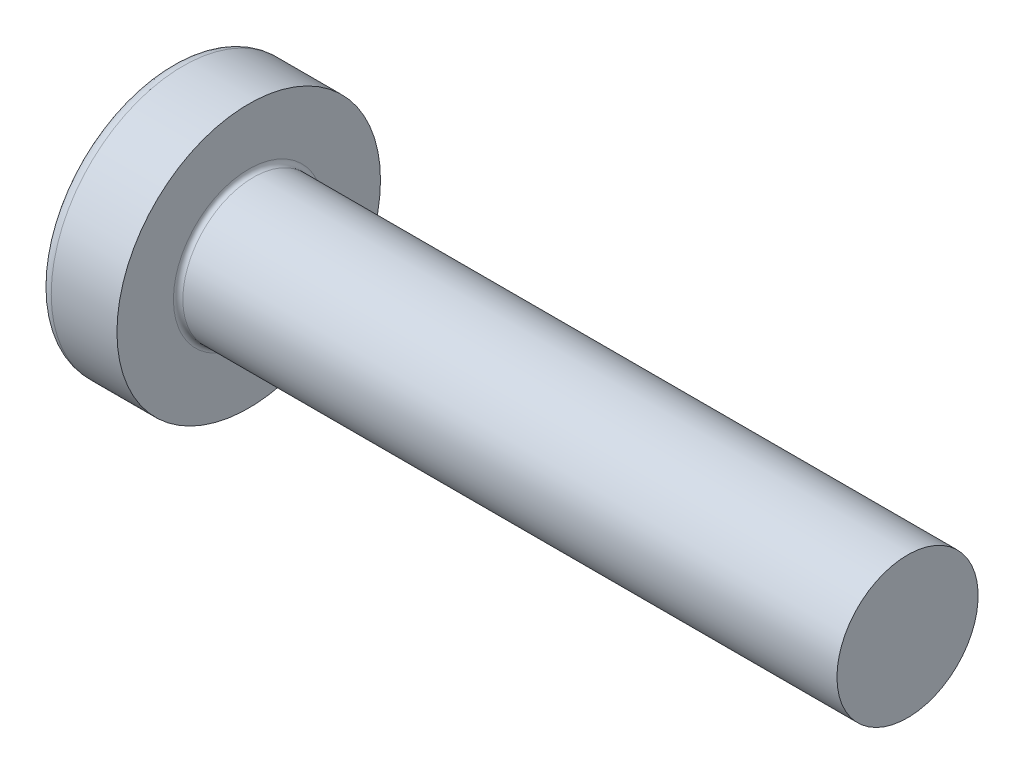
ISO-10303-21;
HEADER;
FILE_DESCRIPTION(('STEP AP214'),'2;1');
FILE_NAME('part.step','',(''),(''),'','','');
FILE_SCHEMA(('AUTOMOTIVE_DESIGN { 1 0 10303 214 1 1 1 1 }'));
ENDSEC;
DATA;
#1=APPLICATION_CONTEXT('core data for automotive mechanical design processes');
#2=APPLICATION_PROTOCOL_DEFINITION('international standard','automotive_design',2000,#1);
#3=PRODUCT_CONTEXT('',#1,'mechanical');
#4=PRODUCT('Part','Part','',(#3));
#5=PRODUCT_RELATED_PRODUCT_CATEGORY('part','',(#4));
#6=PRODUCT_DEFINITION_FORMATION('','',#4);
#7=PRODUCT_DEFINITION_CONTEXT('part definition',#1,'design');
#8=PRODUCT_DEFINITION('design','',#6,#7);
#9=PRODUCT_DEFINITION_SHAPE('','',#8);
#10=(LENGTH_UNIT() NAMED_UNIT(*) SI_UNIT(.MILLI.,.METRE.));
#11=(NAMED_UNIT(*) PLANE_ANGLE_UNIT() SI_UNIT($,.RADIAN.));
#12=(NAMED_UNIT(*) SI_UNIT($,.STERADIAN.) SOLID_ANGLE_UNIT());
#13=UNCERTAINTY_MEASURE_WITH_UNIT(LENGTH_MEASURE(1.E-05),#10,'distance_accuracy_value','');
#14=(GEOMETRIC_REPRESENTATION_CONTEXT(3) GLOBAL_UNCERTAINTY_ASSIGNED_CONTEXT((#13)) GLOBAL_UNIT_ASSIGNED_CONTEXT((#10,
#11,#12)) REPRESENTATION_CONTEXT('',''));
#15=CARTESIAN_POINT('',(0.,0.,0.));
#16=DIRECTION('',(0.,0.,1.));
#17=DIRECTION('',(1.,0.,0.));
#18=AXIS2_PLACEMENT_3D('',#15,#16,#17);
#19=CARTESIAN_POINT('',(5.,0.,0.));
#20=DIRECTION('',(-1.,0.,0.));
#21=DIRECTION('',(0.,1.,0.));
#22=AXIS2_PLACEMENT_3D('',#19,#20,#21);
#23=SPHERICAL_SURFACE('',#22,5.);
#24=CARTESIAN_POINT('',(0.775371598933733,0.,0.));
#25=DIRECTION('',(-1.,0.,0.));
#26=DIRECTION('',(0.,0.,1.));
#27=AXIS2_PLACEMENT_3D('',#24,#25,#26);
#28=CIRCLE('',#27,2.67441860465116);
#29=CARTESIAN_POINT('',(0.775371598933733,0.,2.67441860465116));
#30=VERTEX_POINT('',#29);
#31=EDGE_CURVE('E237',#30,#30,#28,.T.);
#32=ORIENTED_EDGE('',*,*,#31,.T.);
#33=EDGE_LOOP('',(#32));
#34=FACE_BOUND('',#33,.T.);
#35=CARTESIAN_POINT('',(0.0457951200896417,0.,0.));
#36=DIRECTION('',(1.,0.,0.));
#37=DIRECTION('',(0.,0.,-1.));
#38=AXIS2_PLACEMENT_3D('',#35,#36,#37);
#39=CIRCLE('',#38,0.675169614150692);
#40=CARTESIAN_POINT('',(0.0457951200896434,-0.369999999999998,-0.564760133040918));
#41=VERTEX_POINT('',#40);
#42=CARTESIAN_POINT('',(0.0457951200896417,-0.564760133040916,-0.37));
#43=VERTEX_POINT('',#42);
#44=EDGE_CURVE('E373',#41,#43,#39,.F.);
#45=ORIENTED_EDGE('',*,*,#44,.F.);
#46=CARTESIAN_POINT('',(5.,-0.37,0.));
#47=DIRECTION('',(0.,1.,0.));
#48=DIRECTION('',(0.,0.,1.));
#49=AXIS2_PLACEMENT_3D('',#46,#47,#48);
#50=CIRCLE('',#49,4.98629120689917);
#51=CARTESIAN_POINT('',(0.18786973422864,-0.369999999999995,-1.30633162146802));
#52=VERTEX_POINT('',#51);
#53=EDGE_CURVE('E299',#52,#41,#50,.T.);
#54=ORIENTED_EDGE('',*,*,#53,.F.);
#55=CARTESIAN_POINT('',(4.56358262530798,0.,0.87531798330592));
#56=DIRECTION('',(0.446197753347436,0.,-0.894934391398443));
#57=DIRECTION('',(-0.894934391398442,0.,-0.446197753347436));
#58=AXIS2_PLACEMENT_3D('',#55,#56,#57);
#59=CIRCLE('',#58,4.90340272700175);
#60=CARTESIAN_POINT('',(0.18786973422864,0.370000000000005,-1.30633162146802));
#61=VERTEX_POINT('',#60);
#62=EDGE_CURVE('E271',#52,#61,#59,.T.);
#63=ORIENTED_EDGE('',*,*,#62,.T.);
#64=CARTESIAN_POINT('',(5.,0.37,0.));
#65=DIRECTION('',(0.,-1.,0.));
#66=DIRECTION('',(0.,0.,-1.));
#67=AXIS2_PLACEMENT_3D('',#64,#65,#66);
#68=CIRCLE('',#67,4.98629120689917);
#69=CARTESIAN_POINT('',(0.0457951200896425,0.370000000000002,-0.564760133040916));
#70=VERTEX_POINT('',#69);
#71=EDGE_CURVE('E326',#70,#61,#68,.T.);
#72=ORIENTED_EDGE('',*,*,#71,.F.);
#73=CARTESIAN_POINT('',(0.0457951200896417,0.564760133040915,-0.37));
#74=VERTEX_POINT('',#73);
#75=EDGE_CURVE('E392',#74,#70,#39,.F.);
#76=ORIENTED_EDGE('',*,*,#75,.F.);
#77=CARTESIAN_POINT('',(5.,0.,-0.37));
#78=DIRECTION('',(0.,0.,1.));
#79=DIRECTION('',(1.,0.,0.));
#80=AXIS2_PLACEMENT_3D('',#77,#78,#79);
#81=CIRCLE('',#80,4.98629120689917);
#82=CARTESIAN_POINT('',(0.187869734228641,1.30633162146802,-0.37));
#83=VERTEX_POINT('',#82);
#84=EDGE_CURVE('E265',#83,#74,#81,.T.);
#85=ORIENTED_EDGE('',*,*,#84,.F.);
#86=CARTESIAN_POINT('',(4.56358262530798,-0.875317983305919,0.));
#87=DIRECTION('',(0.446197753347436,0.894934391398443,0.));
#88=DIRECTION('',(-0.894934391398443,0.446197753347436,0.));
#89=AXIS2_PLACEMENT_3D('',#86,#87,#88);
#90=CIRCLE('',#89,4.90340272700175);
#91=CARTESIAN_POINT('',(0.187869734228641,1.30633162146802,0.37));
#92=VERTEX_POINT('',#91);
#93=EDGE_CURVE('E268',#83,#92,#90,.T.);
#94=ORIENTED_EDGE('',*,*,#93,.T.);
#95=CARTESIAN_POINT('',(5.,0.,0.37));
#96=DIRECTION('',(0.,0.,-1.));
#97=DIRECTION('',(0.,1.,0.));
#98=AXIS2_PLACEMENT_3D('',#95,#96,#97);
#99=CIRCLE('',#98,4.98629120689917);
#100=CARTESIAN_POINT('',(0.0457951200896417,0.564760133040911,0.37));
#101=VERTEX_POINT('',#100);
#102=EDGE_CURVE('E261',#101,#92,#99,.T.);
#103=ORIENTED_EDGE('',*,*,#102,.F.);
#104=CARTESIAN_POINT('',(0.0457951200896434,0.369999999999998,0.564760133040918));
#105=VERTEX_POINT('',#104);
#106=EDGE_CURVE('E391',#105,#101,#39,.F.);
#107=ORIENTED_EDGE('',*,*,#106,.F.);
#108=CARTESIAN_POINT('',(0.187869734228641,0.369999999999995,1.30633162146802));
#109=VERTEX_POINT('',#108);
#110=EDGE_CURVE('E281',#109,#105,#68,.T.);
#111=ORIENTED_EDGE('',*,*,#110,.F.);
#112=CARTESIAN_POINT('',(4.56358262530798,0.,-0.875317983305919));
#113=DIRECTION('',(0.446197753347436,0.,0.894934391398443));
#114=DIRECTION('',(0.894934391398443,0.,-0.446197753347436));
#115=AXIS2_PLACEMENT_3D('',#112,#113,#114);
#116=CIRCLE('',#115,4.90340272700175);
#117=CARTESIAN_POINT('',(0.187869734228641,-0.370000000000005,1.30633162146802));
#118=VERTEX_POINT('',#117);
#119=EDGE_CURVE('E48',#109,#118,#116,.T.);
#120=ORIENTED_EDGE('',*,*,#119,.T.);
#121=CARTESIAN_POINT('',(0.0457951200896429,-0.370000000000002,0.564760133040916));
#122=VERTEX_POINT('',#121);
#123=EDGE_CURVE('E278',#122,#118,#50,.T.);
#124=ORIENTED_EDGE('',*,*,#123,.F.);
#125=CARTESIAN_POINT('',(0.0457951200896417,-0.564760133040911,0.37));
#126=VERTEX_POINT('',#125);
#127=EDGE_CURVE('E431',#126,#122,#39,.F.);
#128=ORIENTED_EDGE('',*,*,#127,.F.);
#129=CARTESIAN_POINT('',(0.18786973422864,-1.30633162146802,0.37));
#130=VERTEX_POINT('',#129);
#131=EDGE_CURVE('E262',#130,#126,#99,.T.);
#132=ORIENTED_EDGE('',*,*,#131,.F.);
#133=CARTESIAN_POINT('',(4.56358262530798,0.87531798330592,0.));
#134=DIRECTION('',(0.446197753347436,-0.894934391398443,0.));
#135=DIRECTION('',(0.894934391398442,0.446197753347436,0.));
#136=AXIS2_PLACEMENT_3D('',#133,#134,#135);
#137=CIRCLE('',#136,4.90340272700175);
#138=CARTESIAN_POINT('',(0.18786973422864,-1.30633162146802,-0.37));
#139=VERTEX_POINT('',#138);
#140=EDGE_CURVE('E258',#130,#139,#137,.T.);
#141=ORIENTED_EDGE('',*,*,#140,.T.);
#142=EDGE_CURVE('E63',#43,#139,#81,.T.);
#143=ORIENTED_EDGE('',*,*,#142,.F.);
#144=EDGE_LOOP('',(#45,#54,#63,#72,#76,#85,#94,#103,#107,#111,#120,#124,#128,#132,#141,#143));
#145=FACE_BOUND('',#144,.T.);
#146=ADVANCED_FACE('F34',(#34,#145),#23,.T.);
#147=CARTESIAN_POINT('',(1.75,0.527482331818931,-0.37));
#148=DIRECTION('',(0.,0.,1.));
#149=DIRECTION('',(1.,0.,0.));
#150=AXIS2_PLACEMENT_3D('',#147,#148,#149);
#151=PLANE('',#150);
#152=ORIENTED_EDGE('',*,*,#84,.T.);
#153=CARTESIAN_POINT('',(-0.987293237053716,0.649401255967161,-0.37));
#154=CARTESIAN_POINT('',(-0.781914975317084,0.632865887002871,-0.37));
#155=CARTESIAN_POINT('',(-0.576547882393372,0.616188977635081,-0.37));
#156=CARTESIAN_POINT('',(-0.165841599226327,0.582441031964227,-0.37));
#157=CARTESIAN_POINT('',(0.0394975903090452,0.56536998705488,-0.37));
#158=CARTESIAN_POINT('',(0.450133475422572,0.530723441326535,-0.37));
#159=CARTESIAN_POINT('',(0.655430171010573,0.513147940624557,-0.37));
#160=CARTESIAN_POINT('',(1.06596140177934,0.477314957985794,-0.37));
#161=CARTESIAN_POINT('',(1.2711959378071,0.459057485806066,-0.37));
#162=CARTESIAN_POINT('',(1.61065292365626,0.428051938688768,-0.37));
#163=CARTESIAN_POINT('',(1.74490059995643,0.415580824990931,-0.37));
#164=CARTESIAN_POINT('',(2.01334321762763,0.390092023404979,-0.37));
#165=CARTESIAN_POINT('',(2.14753815934577,0.377074339177353,-0.37));
#166=CARTESIAN_POINT('',(2.41586354151957,0.350315629452843,-0.37));
#167=CARTESIAN_POINT('',(2.5499939784531,0.33657456817765,-0.37));
#168=CARTESIAN_POINT('',(2.81814173295471,0.308004077741875,-0.37));
#169=CARTESIAN_POINT('',(2.95215904765134,0.293174621747065,-0.37));
#170=CARTESIAN_POINT('',(3.0860955068368,0.277618485071816,-0.37));
#171=B_SPLINE_CURVE_WITH_KNOTS('',3,(#153,#154,#155,#156,#157,#158,#159,#160,#161,#162,#163,
#164,#165,#166,#167,#168,#169,#170),.UNSPECIFIED.,.F.,.F.,(4,2,2,2,2,2,2,2,4),(0.,
0.618128793984691,1.23627109812525,1.85441325887562,2.4725465791681,2.87702276218609,
3.28149623678161,3.68598973550942,4.09049321032311),.UNSPECIFIED.);
#172=CARTESIAN_POINT('',(1.75,0.415013252800437,-0.370000000000001));
#173=VERTEX_POINT('',#172);
#174=EDGE_CURVE('E415',#74,#173,#171,.T.);
#175=ORIENTED_EDGE('',*,*,#174,.T.);
#176=DIRECTION('',(0.,1.,0.));
#177=VECTOR('',#176,1.);
#178=CARTESIAN_POINT('',(1.75,-0.527482331818931,-0.37));
#179=LINE('',#178,#177);
#180=CARTESIAN_POINT('',(1.75,0.527482331818932,-0.37));
#181=VERTEX_POINT('',#180);
#182=EDGE_CURVE('E355',#173,#181,#179,.T.);
#183=ORIENTED_EDGE('',*,*,#182,.T.);
#184=DIRECTION('',(0.894934391398442,-0.446197753347436,0.));
#185=VECTOR('',#184,1.);
#186=CARTESIAN_POINT('',(0.,1.4,-0.37));
#187=LINE('',#186,#185);
#188=EDGE_CURVE('E238',#83,#181,#187,.T.);
#189=ORIENTED_EDGE('',*,*,#188,.F.);
#190=EDGE_LOOP('',(#152,#175,#183,#189));
#191=FACE_BOUND('',#190,.T.);
#192=ADVANCED_FACE('F193',(#191),#151,.T.);
#193=CARTESIAN_POINT('',(1.75,-0.527482331818931,-0.37));
#194=VERTEX_POINT('',#193);
#195=CARTESIAN_POINT('',(1.75,-0.415013252800437,-0.370000000000001));
#196=VERTEX_POINT('',#195);
#197=EDGE_CURVE('E246',#194,#196,#179,.T.);
#198=ORIENTED_EDGE('',*,*,#197,.T.);
#199=CARTESIAN_POINT('',(-0.987293237053716,-0.649401255967161,-0.37));
#200=CARTESIAN_POINT('',(-0.781914975317084,-0.632865887002871,-0.37));
#201=CARTESIAN_POINT('',(-0.576547882393372,-0.616188977635081,-0.37));
#202=CARTESIAN_POINT('',(-0.165841599226327,-0.582441031964227,-0.37));
#203=CARTESIAN_POINT('',(0.0394975903090452,-0.56536998705488,-0.37));
#204=CARTESIAN_POINT('',(0.450133475422572,-0.530723441326535,-0.37));
#205=CARTESIAN_POINT('',(0.655430171010573,-0.513147940624557,-0.37));
#206=CARTESIAN_POINT('',(1.06596140177934,-0.477314957985794,-0.37));
#207=CARTESIAN_POINT('',(1.2711959378071,-0.459057485806066,-0.37));
#208=CARTESIAN_POINT('',(1.61065292365626,-0.428051938688768,-0.37));
#209=CARTESIAN_POINT('',(1.74490059995643,-0.415580824990931,-0.37));
#210=CARTESIAN_POINT('',(2.01334321762763,-0.390092023404979,-0.37));
#211=CARTESIAN_POINT('',(2.14753815934577,-0.377074339177353,-0.37));
#212=CARTESIAN_POINT('',(2.41586354151957,-0.350315629452843,-0.37));
#213=CARTESIAN_POINT('',(2.5499939784531,-0.33657456817765,-0.37));
#214=CARTESIAN_POINT('',(2.81814173295471,-0.308004077741875,-0.37));
#215=CARTESIAN_POINT('',(2.95215904765134,-0.293174621747065,-0.37));
#216=CARTESIAN_POINT('',(3.0860955068368,-0.277618485071816,-0.37));
#217=B_SPLINE_CURVE_WITH_KNOTS('',3,(#199,#200,#201,#202,#203,#204,#205,#206,#207,#208,#209,
#210,#211,#212,#213,#214,#215,#216),.UNSPECIFIED.,.F.,.F.,(4,2,2,2,2,2,2,2,4),(0.,
0.618128793984691,1.23627109812525,1.85441325887562,2.4725465791681,2.87702276218609,
3.28149623678161,3.68598973550942,4.09049321032311),.UNSPECIFIED.);
#218=EDGE_CURVE('E390',#196,#43,#217,.F.);
#219=ORIENTED_EDGE('',*,*,#218,.T.);
#220=ORIENTED_EDGE('',*,*,#142,.T.);
#221=DIRECTION('',(0.894934391398442,0.446197753347436,0.));
#222=VECTOR('',#221,1.);
#223=CARTESIAN_POINT('',(0.,-1.4,-0.37));
#224=LINE('',#223,#222);
#225=EDGE_CURVE('E329',#139,#194,#224,.T.);
#226=ORIENTED_EDGE('',*,*,#225,.T.);
#227=EDGE_LOOP('',(#198,#219,#220,#226));
#228=FACE_BOUND('',#227,.T.);
#229=ADVANCED_FACE('F199',(#228),#151,.T.);
#230=CARTESIAN_POINT('',(1.75,-0.527482331818931,0.37));
#231=DIRECTION('',(0.,0.,-1.));
#232=DIRECTION('',(0.,1.,0.));
#233=AXIS2_PLACEMENT_3D('',#230,#231,#232);
#234=PLANE('',#233);
#235=DIRECTION('',(0.,-1.,0.));
#236=VECTOR('',#235,1.);
#237=CARTESIAN_POINT('',(1.75,0.527482331818931,0.37));
#238=LINE('',#237,#236);
#239=CARTESIAN_POINT('',(1.75,0.527482331818932,0.37));
#240=VERTEX_POINT('',#239);
#241=CARTESIAN_POINT('',(1.75,0.415013252800437,0.370000000000001));
#242=VERTEX_POINT('',#241);
#243=EDGE_CURVE('E338',#240,#242,#238,.T.);
#244=ORIENTED_EDGE('',*,*,#243,.T.);
#245=CARTESIAN_POINT('',(-0.987293237053716,0.649401255967161,0.37));
#246=CARTESIAN_POINT('',(-0.781914975317084,0.632865887002871,0.37));
#247=CARTESIAN_POINT('',(-0.576547882393372,0.616188977635081,0.37));
#248=CARTESIAN_POINT('',(-0.165841599226327,0.582441031964227,0.37));
#249=CARTESIAN_POINT('',(0.0394975903090453,0.56536998705488,0.37));
#250=CARTESIAN_POINT('',(0.450133475422572,0.530723441326535,0.37));
#251=CARTESIAN_POINT('',(0.655430171010574,0.513147940624557,0.37));
#252=CARTESIAN_POINT('',(1.06596140177934,0.477314957985794,0.37));
#253=CARTESIAN_POINT('',(1.2711959378071,0.459057485806066,0.37));
#254=CARTESIAN_POINT('',(1.61065292365626,0.428051938688768,0.37));
#255=CARTESIAN_POINT('',(1.74490059995643,0.415580824990931,0.37));
#256=CARTESIAN_POINT('',(2.01334321762763,0.39009202340498,0.37));
#257=CARTESIAN_POINT('',(2.14753815934577,0.377074339177353,0.37));
#258=CARTESIAN_POINT('',(2.41586354151957,0.350315629452843,0.37));
#259=CARTESIAN_POINT('',(2.5499939784531,0.33657456817765,0.37));
#260=CARTESIAN_POINT('',(2.81814173295471,0.308004077741875,0.37));
#261=CARTESIAN_POINT('',(2.95215904765134,0.293174621747065,0.37));
#262=CARTESIAN_POINT('',(3.0860955068368,0.277618485071816,0.37));
#263=B_SPLINE_CURVE_WITH_KNOTS('',3,(#245,#246,#247,#248,#249,#250,#251,#252,#253,#254,#255,
#256,#257,#258,#259,#260,#261,#262),.UNSPECIFIED.,.F.,.F.,(4,2,2,2,2,2,2,2,4),(0.,
0.618128793984691,1.23627109812525,1.85441325887562,2.4725465791681,2.87702276218609,
3.28149623678161,3.68598973550942,4.09049321032311),.UNSPECIFIED.);
#264=EDGE_CURVE('E670',#242,#101,#263,.F.);
#265=ORIENTED_EDGE('',*,*,#264,.T.);
#266=ORIENTED_EDGE('',*,*,#102,.T.);
#267=DIRECTION('',(0.894934391398442,-0.446197753347436,0.));
#268=VECTOR('',#267,1.);
#269=CARTESIAN_POINT('',(0.,1.4,0.37));
#270=LINE('',#269,#268);
#271=EDGE_CURVE('E243',#92,#240,#270,.T.);
#272=ORIENTED_EDGE('',*,*,#271,.T.);
#273=EDGE_LOOP('',(#244,#265,#266,#272));
#274=FACE_BOUND('',#273,.T.);
#275=ADVANCED_FACE('F411',(#274),#234,.T.);
#276=ORIENTED_EDGE('',*,*,#131,.T.);
#277=CARTESIAN_POINT('',(-0.987293237069635,-0.649401255968442,0.37));
#278=CARTESIAN_POINT('',(-0.781914975331301,-0.632865887004023,0.37));
#279=CARTESIAN_POINT('',(-0.576547882405888,-0.616188977636102,0.37));
#280=CARTESIAN_POINT('',(-0.16584159923544,-0.582441031964983,0.37));
#281=CARTESIAN_POINT('',(0.0394975903016338,-0.5653699870555,0.37));
#282=CARTESIAN_POINT('',(0.450133475420601,-0.530723441326706,0.37));
#283=CARTESIAN_POINT('',(0.655430171012341,-0.513147940624409,0.37));
#284=CARTESIAN_POINT('',(1.06596140178858,-0.477314957984981,0.37));
#285=CARTESIAN_POINT('',(1.27119593782008,-0.459057485804908,0.37));
#286=CARTESIAN_POINT('',(1.61065292367297,-0.428051938687225,0.37));
#287=CARTESIAN_POINT('',(1.74490059997313,-0.415580824989368,0.37));
#288=CARTESIAN_POINT('',(2.01334321764434,-0.390092023403371,0.37));
#289=CARTESIAN_POINT('',(2.14753815936247,-0.377074339175718,0.37));
#290=CARTESIAN_POINT('',(2.41586354153627,-0.350315629451146,0.37));
#291=CARTESIAN_POINT('',(2.54999397846979,-0.336574568175918,0.37));
#292=CARTESIAN_POINT('',(2.8181417329714,-0.308004077740054,0.37));
#293=CARTESIAN_POINT('',(2.95215904766802,-0.29317462174519,0.37));
#294=CARTESIAN_POINT('',(3.08609550685347,-0.277618485069873,0.37));
#295=B_SPLINE_CURVE_WITH_KNOTS('',3,(#277,#278,#279,#280,#281,#282,#283,#284,#285,#286,#287,
#288,#289,#290,#291,#292,#293,#294),.UNSPECIFIED.,.F.,.F.,(4,2,2,2,2,2,2,2,4),(0.,
0.61812879398981,1.23627109813549,1.85441325889711,2.47254657920086,2.87702276221884,
3.28149623681437,3.68598973554218,4.09049321035586),.UNSPECIFIED.);
#296=CARTESIAN_POINT('',(1.75,-0.415013252800437,0.37));
#297=VERTEX_POINT('',#296);
#298=EDGE_CURVE('E432',#126,#297,#295,.T.);
#299=ORIENTED_EDGE('',*,*,#298,.T.);
#300=CARTESIAN_POINT('',(1.75,-0.527482331818931,0.37));
#301=VERTEX_POINT('',#300);
#302=EDGE_CURVE('E340',#297,#301,#238,.T.);
#303=ORIENTED_EDGE('',*,*,#302,.T.);
#304=DIRECTION('',(0.894934391398442,0.446197753347436,0.));
#305=VECTOR('',#304,1.);
#306=CARTESIAN_POINT('',(0.,-1.4,0.37));
#307=LINE('',#306,#305);
#308=EDGE_CURVE('E331',#130,#301,#307,.T.);
#309=ORIENTED_EDGE('',*,*,#308,.F.);
#310=EDGE_LOOP('',(#276,#299,#303,#309));
#311=FACE_BOUND('',#310,.T.);
#312=ADVANCED_FACE('F518',(#311),#234,.T.);
#313=CARTESIAN_POINT('',(1.75,0.527482331818931,0.37));
#314=DIRECTION('',(0.446197753347436,0.894934391398443,0.));
#315=DIRECTION('',(-0.894934391398443,0.446197753347436,0.));
#316=AXIS2_PLACEMENT_3D('',#313,#314,#315);
#317=PLANE('',#316);
#318=CARTESIAN_POINT('',(2.6696526882832,0.0689604923233252,0.));
#319=DIRECTION('',(0.446197753347436,0.894934391398443,0.));
#320=DIRECTION('',(-0.894934391398443,0.446197753347436,0.));
#321=AXIS2_PLACEMENT_3D('',#318,#319,#320);
#322=ELLIPSE('',#321,1.10195897609154,0.486831694838766);
#323=CARTESIAN_POINT('',(1.75,0.527482331818932,0.17577937768368));
#324=VERTEX_POINT('',#323);
#325=CARTESIAN_POINT('',(1.75,0.527482331818932,-0.17577937768368));
#326=VERTEX_POINT('',#325);
#327=EDGE_CURVE('E304',#324,#326,#322,.F.);
#328=ORIENTED_EDGE('',*,*,#327,.F.);
#329=DIRECTION('',(0.,0.,-1.));
#330=VECTOR('',#329,1.);
#331=CARTESIAN_POINT('',(1.75,0.527482331818931,0.37));
#332=LINE('',#331,#330);
#333=EDGE_CURVE('E341',#240,#324,#332,.T.);
#334=ORIENTED_EDGE('',*,*,#333,.F.);
#335=ORIENTED_EDGE('',*,*,#271,.F.);
#336=ORIENTED_EDGE('',*,*,#93,.F.);
#337=ORIENTED_EDGE('',*,*,#188,.T.);
#338=EDGE_CURVE('E343',#326,#181,#332,.T.);
#339=ORIENTED_EDGE('',*,*,#338,.F.);
#340=EDGE_LOOP('',(#328,#334,#335,#336,#337,#339));
#341=FACE_BOUND('',#340,.T.);
#342=ADVANCED_FACE('F409',(#341),#317,.F.);
#343=CARTESIAN_POINT('',(0.,-1.4,-0.37));
#344=DIRECTION('',(0.446197753347436,-0.894934391398443,0.));
#345=DIRECTION('',(0.894934391398442,0.446197753347436,0.));
#346=AXIS2_PLACEMENT_3D('',#343,#344,#345);
#347=PLANE('',#346);
#348=CARTESIAN_POINT('',(2.6696526882832,-0.0689604923233248,0.));
#349=DIRECTION('',(0.446197753347436,-0.894934391398443,0.));
#350=DIRECTION('',(-0.894934391398443,-0.446197753347436,0.));
#351=AXIS2_PLACEMENT_3D('',#348,#349,#350);
#352=ELLIPSE('',#351,1.10195897609154,0.486831694838766);
#353=CARTESIAN_POINT('',(1.75,-0.527482331818932,-0.175779377683682));
#354=VERTEX_POINT('',#353);
#355=CARTESIAN_POINT('',(1.75,-0.527482331818932,0.175779377683682));
#356=VERTEX_POINT('',#355);
#357=EDGE_CURVE('E672',#354,#356,#352,.F.);
#358=ORIENTED_EDGE('',*,*,#357,.F.);
#359=DIRECTION('',(0.,0.,1.));
#360=VECTOR('',#359,1.);
#361=CARTESIAN_POINT('',(1.75,-0.527482331818931,-0.37));
#362=LINE('',#361,#360);
#363=EDGE_CURVE('E334',#194,#354,#362,.T.);
#364=ORIENTED_EDGE('',*,*,#363,.F.);
#365=ORIENTED_EDGE('',*,*,#225,.F.);
#366=ORIENTED_EDGE('',*,*,#140,.F.);
#367=ORIENTED_EDGE('',*,*,#308,.T.);
#368=EDGE_CURVE('E337',#356,#301,#362,.T.);
#369=ORIENTED_EDGE('',*,*,#368,.F.);
#370=EDGE_LOOP('',(#358,#364,#365,#366,#367,#369));
#371=FACE_BOUND('',#370,.T.);
#372=ADVANCED_FACE('F505',(#371),#347,.F.);
#373=CARTESIAN_POINT('',(1.75,0.527482331818931,-0.37));
#374=DIRECTION('',(-1.,0.,0.));
#375=DIRECTION('',(0.,0.,1.));
#376=AXIS2_PLACEMENT_3D('',#373,#374,#375);
#377=PLANE('',#376);
#378=DIRECTION('',(0.,1.,0.));
#379=VECTOR('',#378,1.);
#380=CARTESIAN_POINT('',(1.75,-0.370000000000002,0.52748233181893));
#381=LINE('',#380,#379);
#382=CARTESIAN_POINT('',(1.75,-0.370000000000002,0.52748233181893));
#383=VERTEX_POINT('',#382);
#384=CARTESIAN_POINT('',(1.75,-0.175779377683684,0.527482331818931));
#385=VERTEX_POINT('',#384);
#386=EDGE_CURVE('E319',#383,#385,#381,.T.);
#387=ORIENTED_EDGE('',*,*,#386,.T.);
#388=CARTESIAN_POINT('',(1.75,0.,0.));
#389=DIRECTION('',(-1.,0.,0.));
#390=DIRECTION('',(0.,0.,1.));
#391=AXIS2_PLACEMENT_3D('',#388,#389,#390);
#392=CIRCLE('',#391,0.556);
#393=CARTESIAN_POINT('',(1.75,-0.370000000000001,0.415013252800436));
#394=VERTEX_POINT('',#393);
#395=EDGE_CURVE('E700',#394,#385,#392,.T.);
#396=ORIENTED_EDGE('',*,*,#395,.F.);
#397=DIRECTION('',(0.,0.,-1.));
#398=VECTOR('',#397,1.);
#399=CARTESIAN_POINT('',(1.75,-0.370000000000002,0.52748233181893));
#400=LINE('',#399,#398);
#401=EDGE_CURVE('E315',#383,#394,#400,.T.);
#402=ORIENTED_EDGE('',*,*,#401,.F.);
#403=EDGE_LOOP('',(#387,#396,#402));
#404=FACE_BOUND('',#403,.T.);
#405=ADVANCED_FACE('F498',(#404),#377,.T.);
#406=ORIENTED_EDGE('',*,*,#302,.F.);
#407=EDGE_CURVE('E705',#356,#297,#392,.T.);
#408=ORIENTED_EDGE('',*,*,#407,.F.);
#409=ORIENTED_EDGE('',*,*,#368,.T.);
#410=EDGE_LOOP('',(#406,#408,#409));
#411=FACE_BOUND('',#410,.T.);
#412=ADVANCED_FACE('F491',(#411),#377,.T.);
#413=ORIENTED_EDGE('',*,*,#363,.T.);
#414=EDGE_CURVE('E384',#196,#354,#392,.T.);
#415=ORIENTED_EDGE('',*,*,#414,.F.);
#416=ORIENTED_EDGE('',*,*,#197,.F.);
#417=EDGE_LOOP('',(#413,#415,#416));
#418=FACE_BOUND('',#417,.T.);
#419=ADVANCED_FACE('F485',(#418),#377,.T.);
#420=CARTESIAN_POINT('',(1.75,-0.369999999999998,-0.415013252800438));
#421=VERTEX_POINT('',#420);
#422=CARTESIAN_POINT('',(1.75,-0.369999999999998,-0.527482331818932));
#423=VERTEX_POINT('',#422);
#424=EDGE_CURVE('E318',#421,#423,#400,.T.);
#425=ORIENTED_EDGE('',*,*,#424,.F.);
#426=CARTESIAN_POINT('',(1.75,-0.175779377683682,-0.527482331818932));
#427=VERTEX_POINT('',#426);
#428=EDGE_CURVE('E55',#427,#421,#392,.T.);
#429=ORIENTED_EDGE('',*,*,#428,.F.);
#430=DIRECTION('',(0.,-1.,0.));
#431=VECTOR('',#430,1.);
#432=CARTESIAN_POINT('',(1.75,0.370000000000002,-0.52748233181893));
#433=LINE('',#432,#431);
#434=EDGE_CURVE('E314',#427,#423,#433,.T.);
#435=ORIENTED_EDGE('',*,*,#434,.T.);
#436=EDGE_LOOP('',(#425,#429,#435));
#437=FACE_BOUND('',#436,.T.);
#438=ADVANCED_FACE('F379',(#437),#377,.T.);
#439=CARTESIAN_POINT('',(1.75,0.370000000000002,-0.52748233181893));
#440=VERTEX_POINT('',#439);
#441=CARTESIAN_POINT('',(1.75,0.175779377683685,-0.527482331818931));
#442=VERTEX_POINT('',#441);
#443=EDGE_CURVE('E311',#440,#442,#433,.T.);
#444=ORIENTED_EDGE('',*,*,#443,.T.);
#445=CARTESIAN_POINT('',(1.75,0.370000000000001,-0.415013252800436));
#446=VERTEX_POINT('',#445);
#447=EDGE_CURVE('E383',#446,#442,#392,.T.);
#448=ORIENTED_EDGE('',*,*,#447,.F.);
#449=DIRECTION('',(0.,0.,1.));
#450=VECTOR('',#449,1.);
#451=CARTESIAN_POINT('',(1.75,0.370000000000002,-0.52748233181893));
#452=LINE('',#451,#450);
#453=EDGE_CURVE('E323',#440,#446,#452,.T.);
#454=ORIENTED_EDGE('',*,*,#453,.F.);
#455=EDGE_LOOP('',(#444,#448,#454));
#456=FACE_BOUND('',#455,.T.);
#457=ADVANCED_FACE('F473',(#456),#377,.T.);
#458=ORIENTED_EDGE('',*,*,#182,.F.);
#459=EDGE_CURVE('E689',#326,#173,#392,.T.);
#460=ORIENTED_EDGE('',*,*,#459,.F.);
#461=ORIENTED_EDGE('',*,*,#338,.T.);
#462=EDGE_LOOP('',(#458,#460,#461));
#463=FACE_BOUND('',#462,.T.);
#464=ADVANCED_FACE('F466',(#463),#377,.T.);
#465=ORIENTED_EDGE('',*,*,#333,.T.);
#466=EDGE_CURVE('E691',#242,#324,#392,.T.);
#467=ORIENTED_EDGE('',*,*,#466,.F.);
#468=ORIENTED_EDGE('',*,*,#243,.F.);
#469=EDGE_LOOP('',(#465,#467,#468));
#470=FACE_BOUND('',#469,.T.);
#471=ADVANCED_FACE('F460',(#470),#377,.T.);
#472=CARTESIAN_POINT('',(1.75,0.369999999999998,0.527482331818933));
#473=DIRECTION('',(0.,-1.,0.));
#474=DIRECTION('',(1.,0.,0.));
#475=AXIS2_PLACEMENT_3D('',#472,#473,#474);
#476=PLANE('',#475);
#477=ORIENTED_EDGE('',*,*,#110,.T.);
#478=CARTESIAN_POINT('',(-0.987293237069635,0.369999999999998,0.649401255968443));
#479=CARTESIAN_POINT('',(-0.781914975331301,0.369999999999998,0.632865887004024));
#480=CARTESIAN_POINT('',(-0.576547882405888,0.369999999999998,0.616188977636103));
#481=CARTESIAN_POINT('',(-0.16584159923544,0.369999999999998,0.582441031964984));
#482=CARTESIAN_POINT('',(0.0394975903016338,0.369999999999998,0.565369987055501));
#483=CARTESIAN_POINT('',(0.450133475420601,0.369999999999998,0.530723441326707));
#484=CARTESIAN_POINT('',(0.655430171012341,0.369999999999998,0.51314794062441));
#485=CARTESIAN_POINT('',(1.06596140178858,0.369999999999998,0.477314957984982));
#486=CARTESIAN_POINT('',(1.27119593782008,0.369999999999998,0.459057485804909));
#487=CARTESIAN_POINT('',(1.61065292367297,0.369999999999999,0.428051938687226));
#488=CARTESIAN_POINT('',(1.74490059997313,0.369999999999999,0.415580824989369));
#489=CARTESIAN_POINT('',(2.01334321764434,0.369999999999999,0.390092023403372));
#490=CARTESIAN_POINT('',(2.14753815936247,0.369999999999999,0.37707433917572));
#491=CARTESIAN_POINT('',(2.41586354153627,0.369999999999999,0.350315629451147));
#492=CARTESIAN_POINT('',(2.54999397846979,0.369999999999999,0.336574568175919));
#493=CARTESIAN_POINT('',(2.8181417329714,0.369999999999999,0.308004077740055));
#494=CARTESIAN_POINT('',(2.95215904766802,0.369999999999999,0.293174621745191));
#495=CARTESIAN_POINT('',(3.08609550685347,0.369999999999999,0.277618485069875));
#496=B_SPLINE_CURVE_WITH_KNOTS('',3,(#478,#479,#480,#481,#482,#483,#484,#485,#486,#487,#488,
#489,#490,#491,#492,#493,#494,#495),.UNSPECIFIED.,.F.,.F.,(4,2,2,2,2,2,2,2,4),(0.,
0.61812879398981,1.23627109813549,1.85441325889711,2.47254657920086,2.87702276221884,
3.28149623681436,3.68598973554218,4.09049321035586),.UNSPECIFIED.);
#497=CARTESIAN_POINT('',(1.75,0.369999999999999,0.415013252800439));
#498=VERTEX_POINT('',#497);
#499=EDGE_CURVE('E669',#105,#498,#496,.T.);
#500=ORIENTED_EDGE('',*,*,#499,.T.);
#501=CARTESIAN_POINT('',(1.75,0.369999999999998,0.527482331818933));
#502=VERTEX_POINT('',#501);
#503=EDGE_CURVE('E296',#498,#502,#452,.T.);
#504=ORIENTED_EDGE('',*,*,#503,.T.);
#505=DIRECTION('',(0.894934391398442,0.,-0.446197753347436));
#506=VECTOR('',#505,1.);
#507=CARTESIAN_POINT('',(0.,0.369999999999995,1.4));
#508=LINE('',#507,#506);
#509=EDGE_CURVE('E289',#109,#502,#508,.T.);
#510=ORIENTED_EDGE('',*,*,#509,.F.);
#511=EDGE_LOOP('',(#477,#500,#504,#510));
#512=FACE_BOUND('',#511,.T.);
#513=ADVANCED_FACE('F293',(#512),#476,.T.);
#514=CARTESIAN_POINT('',(1.75,-0.369999999999998,-0.527482331818932));
#515=DIRECTION('',(0.,1.,0.));
#516=DIRECTION('',(0.,0.,1.));
#517=AXIS2_PLACEMENT_3D('',#514,#515,#516);
#518=PLANE('',#517);
#519=ORIENTED_EDGE('',*,*,#401,.T.);
#520=CARTESIAN_POINT('',(-0.987293237053716,-0.370000000000002,0.64940125596716));
#521=CARTESIAN_POINT('',(-0.781914975317084,-0.370000000000002,0.63286588700287));
#522=CARTESIAN_POINT('',(-0.576547882393372,-0.370000000000002,0.61618897763508));
#523=CARTESIAN_POINT('',(-0.165841599226327,-0.370000000000002,0.582441031964225));
#524=CARTESIAN_POINT('',(0.0394975903090451,-0.370000000000002,0.565369987054878));
#525=CARTESIAN_POINT('',(0.450133475422572,-0.370000000000002,0.530723441326533));
#526=CARTESIAN_POINT('',(0.655430171010573,-0.370000000000002,0.513147940624555));
#527=CARTESIAN_POINT('',(1.06596140177934,-0.370000000000002,0.477314957985793));
#528=CARTESIAN_POINT('',(1.2711959378071,-0.370000000000002,0.459057485806065));
#529=CARTESIAN_POINT('',(1.61065292365626,-0.370000000000001,0.428051938688767));
#530=CARTESIAN_POINT('',(1.74490059995642,-0.370000000000001,0.41558082499093));
#531=CARTESIAN_POINT('',(2.01334321762763,-0.370000000000001,0.390092023404978));
#532=CARTESIAN_POINT('',(2.14753815934577,-0.370000000000001,0.377074339177352));
#533=CARTESIAN_POINT('',(2.41586354151957,-0.370000000000001,0.350315629452841));
#534=CARTESIAN_POINT('',(2.5499939784531,-0.370000000000001,0.336574568177649));
#535=CARTESIAN_POINT('',(2.81814173295471,-0.370000000000001,0.308004077741874));
#536=CARTESIAN_POINT('',(2.95215904765134,-0.370000000000001,0.293174621747063));
#537=CARTESIAN_POINT('',(3.0860955068368,-0.370000000000001,0.277618485071814));
#538=B_SPLINE_CURVE_WITH_KNOTS('',3,(#520,#521,#522,#523,#524,#525,#526,#527,#528,#529,#530,
#531,#532,#533,#534,#535,#536,#537),.UNSPECIFIED.,.F.,.F.,(4,2,2,2,2,2,2,2,4),(0.,
0.618128793984691,1.23627109812525,1.85441325887562,2.4725465791681,2.87702276218609,
3.28149623678161,3.68598973550942,4.09049321032311),.UNSPECIFIED.);
#539=EDGE_CURVE('E424',#394,#122,#538,.F.);
#540=ORIENTED_EDGE('',*,*,#539,.T.);
#541=ORIENTED_EDGE('',*,*,#123,.T.);
#542=DIRECTION('',(0.894934391398442,0.,-0.446197753347436));
#543=VECTOR('',#542,1.);
#544=CARTESIAN_POINT('',(0.,-0.370000000000005,1.4));
#545=LINE('',#544,#543);
#546=EDGE_CURVE('E291',#118,#383,#545,.T.);
#547=ORIENTED_EDGE('',*,*,#546,.T.);
#548=EDGE_LOOP('',(#519,#540,#541,#547));
#549=FACE_BOUND('',#548,.T.);
#550=ADVANCED_FACE('F228',(#549),#518,.T.);
#551=CARTESIAN_POINT('',(1.75,-0.370000000000002,0.52748233181893));
#552=DIRECTION('',(0.446197753347436,0.,0.894934391398443));
#553=DIRECTION('',(-0.894934391398443,0.,0.446197753347436));
#554=AXIS2_PLACEMENT_3D('',#551,#552,#553);
#555=PLANE('',#554);
#556=CARTESIAN_POINT('',(2.6696526882832,0.,0.0689604923233252));
#557=DIRECTION('',(0.446197753347436,0.,0.894934391398443));
#558=DIRECTION('',(-0.894934391398443,0.,0.446197753347436));
#559=AXIS2_PLACEMENT_3D('',#556,#557,#558);
#560=ELLIPSE('',#559,1.10195897609154,0.486831694838766);
#561=CARTESIAN_POINT('',(1.75,0.175779377683681,0.527482331818932));
#562=VERTEX_POINT('',#561);
#563=EDGE_CURVE('E422',#385,#562,#560,.F.);
#564=ORIENTED_EDGE('',*,*,#563,.F.);
#565=ORIENTED_EDGE('',*,*,#386,.F.);
#566=ORIENTED_EDGE('',*,*,#546,.F.);
#567=ORIENTED_EDGE('',*,*,#119,.F.);
#568=ORIENTED_EDGE('',*,*,#509,.T.);
#569=EDGE_CURVE('E322',#562,#502,#381,.T.);
#570=ORIENTED_EDGE('',*,*,#569,.F.);
#571=EDGE_LOOP('',(#564,#565,#566,#567,#568,#570));
#572=FACE_BOUND('',#571,.T.);
#573=ADVANCED_FACE('F287',(#572),#555,.F.);
#574=CARTESIAN_POINT('',(0.,0.370000000000005,-1.4));
#575=DIRECTION('',(0.446197753347436,0.,-0.894934391398443));
#576=DIRECTION('',(0.894934391398442,0.,0.446197753347436));
#577=AXIS2_PLACEMENT_3D('',#574,#575,#576);
#578=PLANE('',#577);
#579=CARTESIAN_POINT('',(2.6696526882832,0.,-0.0689604923233248));
#580=DIRECTION('',(0.446197753347436,0.,-0.894934391398443));
#581=DIRECTION('',(-0.894934391398443,0.,-0.446197753347436));
#582=AXIS2_PLACEMENT_3D('',#579,#580,#581);
#583=ELLIPSE('',#582,1.10195897609154,0.486831694838766);
#584=EDGE_CURVE('E377',#442,#427,#583,.F.);
#585=ORIENTED_EDGE('',*,*,#584,.F.);
#586=ORIENTED_EDGE('',*,*,#443,.F.);
#587=DIRECTION('',(0.894934391398442,0.,0.446197753347436));
#588=VECTOR('',#587,1.);
#589=CARTESIAN_POINT('',(0.,0.370000000000005,-1.4));
#590=LINE('',#589,#588);
#591=EDGE_CURVE('E301',#61,#440,#590,.T.);
#592=ORIENTED_EDGE('',*,*,#591,.F.);
#593=ORIENTED_EDGE('',*,*,#62,.F.);
#594=DIRECTION('',(0.894934391398442,0.,0.446197753347436));
#595=VECTOR('',#594,1.);
#596=CARTESIAN_POINT('',(0.,-0.369999999999995,-1.4));
#597=LINE('',#596,#595);
#598=EDGE_CURVE('E308',#52,#423,#597,.T.);
#599=ORIENTED_EDGE('',*,*,#598,.T.);
#600=ORIENTED_EDGE('',*,*,#434,.F.);
#601=EDGE_LOOP('',(#585,#586,#592,#593,#599,#600));
#602=FACE_BOUND('',#601,.T.);
#603=ADVANCED_FACE('F368',(#602),#578,.F.);
#604=ORIENTED_EDGE('',*,*,#453,.T.);
#605=CARTESIAN_POINT('',(-0.987293237053716,0.370000000000002,-0.649401255967159));
#606=CARTESIAN_POINT('',(-0.781914975317084,0.370000000000002,-0.63286588700287));
#607=CARTESIAN_POINT('',(-0.576547882393372,0.370000000000002,-0.61618897763508));
#608=CARTESIAN_POINT('',(-0.165841599226327,0.370000000000002,-0.582441031964225));
#609=CARTESIAN_POINT('',(0.039497590309045,0.370000000000002,-0.565369987054878));
#610=CARTESIAN_POINT('',(0.450133475422572,0.370000000000002,-0.530723441326533));
#611=CARTESIAN_POINT('',(0.655430171010573,0.370000000000002,-0.513147940624555));
#612=CARTESIAN_POINT('',(1.06596140177934,0.370000000000002,-0.477314957985793));
#613=CARTESIAN_POINT('',(1.2711959378071,0.370000000000002,-0.459057485806065));
#614=CARTESIAN_POINT('',(1.61065292365626,0.370000000000001,-0.428051938688767));
#615=CARTESIAN_POINT('',(1.74490059995642,0.370000000000001,-0.41558082499093));
#616=CARTESIAN_POINT('',(2.01334321762763,0.370000000000001,-0.390092023404978));
#617=CARTESIAN_POINT('',(2.14753815934577,0.370000000000001,-0.377074339177352));
#618=CARTESIAN_POINT('',(2.41586354151957,0.370000000000001,-0.350315629452841));
#619=CARTESIAN_POINT('',(2.5499939784531,0.370000000000001,-0.336574568177649));
#620=CARTESIAN_POINT('',(2.81814173295471,0.370000000000001,-0.308004077741874));
#621=CARTESIAN_POINT('',(2.95215904765134,0.370000000000001,-0.293174621747064));
#622=CARTESIAN_POINT('',(3.0860955068368,0.370000000000001,-0.277618485071814));
#623=B_SPLINE_CURVE_WITH_KNOTS('',3,(#605,#606,#607,#608,#609,#610,#611,#612,#613,#614,#615,
#616,#617,#618,#619,#620,#621,#622),.UNSPECIFIED.,.F.,.F.,(4,2,2,2,2,2,2,2,4),(0.,
0.618128793984691,1.23627109812525,1.85441325887562,2.4725465791681,2.87702276218609,
3.28149623678161,3.68598973550942,4.09049321032311),.UNSPECIFIED.);
#624=EDGE_CURVE('E364',#446,#70,#623,.F.);
#625=ORIENTED_EDGE('',*,*,#624,.T.);
#626=ORIENTED_EDGE('',*,*,#71,.T.);
#627=ORIENTED_EDGE('',*,*,#591,.T.);
#628=EDGE_LOOP('',(#604,#625,#626,#627));
#629=FACE_BOUND('',#628,.T.);
#630=ADVANCED_FACE('F226',(#629),#476,.T.);
#631=ORIENTED_EDGE('',*,*,#53,.T.);
#632=CARTESIAN_POINT('',(-0.987293237069635,-0.369999999999997,-0.649401255968443));
#633=CARTESIAN_POINT('',(-0.781914975331301,-0.369999999999997,-0.632865887004025));
#634=CARTESIAN_POINT('',(-0.576547882405888,-0.369999999999997,-0.616188977636104));
#635=CARTESIAN_POINT('',(-0.16584159923544,-0.369999999999998,-0.582441031964984));
#636=CARTESIAN_POINT('',(0.0394975903016337,-0.369999999999998,-0.565369987055501));
#637=CARTESIAN_POINT('',(0.450133475420601,-0.369999999999998,-0.530723441326707));
#638=CARTESIAN_POINT('',(0.655430171012341,-0.369999999999998,-0.51314794062441));
#639=CARTESIAN_POINT('',(1.06596140178858,-0.369999999999998,-0.477314957984982));
#640=CARTESIAN_POINT('',(1.27119593782008,-0.369999999999998,-0.459057485804909));
#641=CARTESIAN_POINT('',(1.61065292367297,-0.369999999999998,-0.428051938687226));
#642=CARTESIAN_POINT('',(1.74490059997313,-0.369999999999998,-0.415580824989369));
#643=CARTESIAN_POINT('',(2.01334321764434,-0.369999999999999,-0.390092023403372));
#644=CARTESIAN_POINT('',(2.14753815936247,-0.369999999999999,-0.37707433917572));
#645=CARTESIAN_POINT('',(2.41586354153627,-0.369999999999999,-0.350315629451147));
#646=CARTESIAN_POINT('',(2.54999397846979,-0.369999999999999,-0.336574568175919));
#647=CARTESIAN_POINT('',(2.8181417329714,-0.369999999999999,-0.308004077740055));
#648=CARTESIAN_POINT('',(2.95215904766802,-0.369999999999999,-0.293174621745191));
#649=CARTESIAN_POINT('',(3.08609550685347,-0.369999999999999,-0.277618485069875));
#650=B_SPLINE_CURVE_WITH_KNOTS('',3,(#632,#633,#634,#635,#636,#637,#638,#639,#640,#641,#642,
#643,#644,#645,#646,#647,#648,#649),.UNSPECIFIED.,.F.,.F.,(4,2,2,2,2,2,2,2,4),(0.,
0.61812879398981,1.23627109813549,1.85441325889711,2.47254657920086,2.87702276221884,
3.28149623681436,3.68598973554218,4.09049321035586),.UNSPECIFIED.);
#651=EDGE_CURVE('E11',#41,#421,#650,.T.);
#652=ORIENTED_EDGE('',*,*,#651,.T.);
#653=ORIENTED_EDGE('',*,*,#424,.T.);
#654=ORIENTED_EDGE('',*,*,#598,.F.);
#655=EDGE_LOOP('',(#631,#652,#653,#654));
#656=FACE_BOUND('',#655,.T.);
#657=ADVANCED_FACE('F221',(#656),#518,.T.);
#658=CARTESIAN_POINT('',(-25.4,0.,0.));
#659=DIRECTION('',(-1.,0.,0.));
#660=DIRECTION('',(0.,0.,1.));
#661=AXIS2_PLACEMENT_3D('',#658,#659,#660);
#662=CYLINDRICAL_SURFACE('',#661,1.5);
#663=CARTESIAN_POINT('',(2.5,0.,0.));
#664=DIRECTION('',(-1.,0.,0.));
#665=DIRECTION('',(0.,0.,1.));
#666=AXIS2_PLACEMENT_3D('',#663,#664,#665);
#667=CIRCLE('',#666,1.5);
#668=CARTESIAN_POINT('',(2.5,0.,1.5));
#669=VERTEX_POINT('',#668);
#670=EDGE_CURVE('E232',#669,#669,#667,.F.);
#671=ORIENTED_EDGE('',*,*,#670,.T.);
#672=EDGE_LOOP('',(#671));
#673=FACE_BOUND('',#672,.T.);
#674=CARTESIAN_POINT('',(16.4,0.,0.));
#675=DIRECTION('',(-1.,0.,0.));
#676=DIRECTION('',(0.,0.,1.));
#677=AXIS2_PLACEMENT_3D('',#674,#675,#676);
#678=CIRCLE('',#677,1.5);
#679=CARTESIAN_POINT('',(16.4,0.,1.5));
#680=VERTEX_POINT('',#679);
#681=EDGE_CURVE('E235',#680,#680,#678,.T.);
#682=ORIENTED_EDGE('',*,*,#681,.T.);
#683=EDGE_LOOP('',(#682));
#684=FACE_BOUND('',#683,.T.);
#685=ADVANCED_FACE('F218',(#673,#684),#662,.T.);
#686=CARTESIAN_POINT('',(2.4,1.5,0.));
#687=DIRECTION('',(-1.,0.,0.));
#688=DIRECTION('',(0.,0.,1.));
#689=AXIS2_PLACEMENT_3D('',#686,#687,#688);
#690=PLANE('',#689);
#691=CARTESIAN_POINT('',(2.4,0.,0.));
#692=DIRECTION('',(-1.,0.,0.));
#693=DIRECTION('',(0.,0.,1.));
#694=AXIS2_PLACEMENT_3D('',#691,#692,#693);
#695=CIRCLE('',#694,1.6);
#696=CARTESIAN_POINT('',(2.4,0.,1.6));
#697=VERTEX_POINT('',#696);
#698=EDGE_CURVE('E254',#697,#697,#695,.T.);
#699=ORIENTED_EDGE('',*,*,#698,.T.);
#700=EDGE_LOOP('',(#699));
#701=FACE_BOUND('',#700,.T.);
#702=CARTESIAN_POINT('',(2.4,0.,0.));
#703=DIRECTION('',(-1.,0.,0.));
#704=DIRECTION('',(0.,0.,1.));
#705=AXIS2_PLACEMENT_3D('',#702,#703,#704);
#706=CIRCLE('',#705,2.8);
#707=CARTESIAN_POINT('',(2.4,0.,2.8));
#708=VERTEX_POINT('',#707);
#709=EDGE_CURVE('E251',#708,#708,#706,.T.);
#710=ORIENTED_EDGE('',*,*,#709,.F.);
#711=EDGE_LOOP('',(#710));
#712=FACE_BOUND('',#711,.T.);
#713=ADVANCED_FACE('F215',(#701,#712),#690,.F.);
#714=CARTESIAN_POINT('',(-25.4,0.,0.));
#715=DIRECTION('',(-1.,0.,0.));
#716=DIRECTION('',(0.,0.,1.));
#717=AXIS2_PLACEMENT_3D('',#714,#715,#716);
#718=CYLINDRICAL_SURFACE('',#717,2.8);
#719=ORIENTED_EDGE('',*,*,#709,.T.);
#720=EDGE_LOOP('',(#719));
#721=FACE_BOUND('',#720,.T.);
#722=CARTESIAN_POINT('',(1.00350153259131,0.,0.));
#723=DIRECTION('',(-1.,0.,0.));
#724=DIRECTION('',(0.,0.,1.));
#725=AXIS2_PLACEMENT_3D('',#722,#723,#724);
#726=CIRCLE('',#725,2.8);
#727=CARTESIAN_POINT('',(1.00350153259131,0.,2.8));
#728=VERTEX_POINT('',#727);
#729=EDGE_CURVE('E240',#728,#728,#726,.T.);
#730=ORIENTED_EDGE('',*,*,#729,.F.);
#731=EDGE_LOOP('',(#730));
#732=FACE_BOUND('',#731,.T.);
#733=ADVANCED_FACE('F211',(#721,#732),#718,.T.);
#734=CARTESIAN_POINT('',(1.00350153259131,0.,0.));
#735=DIRECTION('',(-1.,0.,0.));
#736=DIRECTION('',(0.,0.,1.));
#737=AXIS2_PLACEMENT_3D('',#734,#735,#736);
#738=TOROIDAL_SURFACE('',#737,2.53,0.27);
#739=ORIENTED_EDGE('',*,*,#729,.T.);
#740=EDGE_LOOP('',(#739));
#741=FACE_BOUND('',#740,.T.);
#742=ORIENTED_EDGE('',*,*,#31,.F.);
#743=EDGE_LOOP('',(#742));
#744=FACE_BOUND('',#743,.T.);
#745=ADVANCED_FACE('F208',(#741,#744),#738,.T.);
#746=CARTESIAN_POINT('',(16.4,1.5,0.));
#747=DIRECTION('',(1.,0.,0.));
#748=DIRECTION('',(0.,0.,-1.));
#749=AXIS2_PLACEMENT_3D('',#746,#747,#748);
#750=PLANE('',#749);
#751=ORIENTED_EDGE('',*,*,#681,.F.);
#752=EDGE_LOOP('',(#751));
#753=FACE_BOUND('',#752,.T.);
#754=ADVANCED_FACE('F206',(#753),#750,.T.);
#755=CARTESIAN_POINT('',(2.5,0.,0.));
#756=DIRECTION('',(-1.,0.,0.));
#757=DIRECTION('',(0.,0.,1.));
#758=AXIS2_PLACEMENT_3D('',#755,#756,#757);
#759=TOROIDAL_SURFACE('',#758,1.6,0.1);
#760=ORIENTED_EDGE('',*,*,#670,.F.);
#761=EDGE_LOOP('',(#760));
#762=FACE_BOUND('',#761,.T.);
#763=ORIENTED_EDGE('',*,*,#698,.F.);
#764=EDGE_LOOP('',(#763));
#765=FACE_BOUND('',#764,.T.);
#766=ADVANCED_FACE('F36',(#762,#765),#759,.F.);
#767=ORIENTED_EDGE('',*,*,#503,.F.);
#768=EDGE_CURVE('E385',#562,#498,#392,.T.);
#769=ORIENTED_EDGE('',*,*,#768,.F.);
#770=ORIENTED_EDGE('',*,*,#569,.T.);
#771=EDGE_LOOP('',(#767,#769,#770));
#772=FACE_BOUND('',#771,.T.);
#773=ADVANCED_FACE('F467',(#772),#377,.T.);
#774=CARTESIAN_POINT('',(1.75,0.,0.));
#775=DIRECTION('',(-1.,0.,0.));
#776=DIRECTION('',(0.,0.,1.));
#777=AXIS2_PLACEMENT_3D('',#774,#775,#776);
#778=CONICAL_SURFACE('',#777,0.556,0.0698131700797659);
#779=ORIENTED_EDGE('',*,*,#327,.T.);
#780=EDGE_CURVE('E686',#324,#326,#392,.T.);
#781=ORIENTED_EDGE('',*,*,#780,.F.);
#782=EDGE_LOOP('',(#779,#781));
#783=FACE_BOUND('',#782,.T.);
#784=ADVANCED_FACE('F190',(#783),#778,.F.);
#785=ORIENTED_EDGE('',*,*,#357,.T.);
#786=EDGE_CURVE('E706',#354,#356,#392,.T.);
#787=ORIENTED_EDGE('',*,*,#786,.F.);
#788=EDGE_LOOP('',(#785,#787));
#789=FACE_BOUND('',#788,.T.);
#790=ADVANCED_FACE('F600',(#789),#778,.F.);
#791=EDGE_CURVE('E387',#498,#242,#392,.T.);
#792=ORIENTED_EDGE('',*,*,#791,.F.);
#793=ORIENTED_EDGE('',*,*,#499,.F.);
#794=ORIENTED_EDGE('',*,*,#106,.T.);
#795=ORIENTED_EDGE('',*,*,#264,.F.);
#796=EDGE_LOOP('',(#792,#793,#794,#795));
#797=FACE_BOUND('',#796,.T.);
#798=ADVANCED_FACE('F606',(#797),#778,.F.);
#799=ORIENTED_EDGE('',*,*,#563,.T.);
#800=EDGE_CURVE('E388',#385,#562,#392,.T.);
#801=ORIENTED_EDGE('',*,*,#800,.F.);
#802=EDGE_LOOP('',(#799,#801));
#803=FACE_BOUND('',#802,.T.);
#804=ADVANCED_FACE('F613',(#803),#778,.F.);
#805=ORIENTED_EDGE('',*,*,#584,.T.);
#806=EDGE_CURVE('E380',#442,#427,#392,.T.);
#807=ORIENTED_EDGE('',*,*,#806,.F.);
#808=EDGE_LOOP('',(#805,#807));
#809=FACE_BOUND('',#808,.T.);
#810=ADVANCED_FACE('F620',(#809),#778,.F.);
#811=ORIENTED_EDGE('',*,*,#127,.T.);
#812=ORIENTED_EDGE('',*,*,#539,.F.);
#813=EDGE_CURVE('E702',#297,#394,#392,.T.);
#814=ORIENTED_EDGE('',*,*,#813,.F.);
#815=ORIENTED_EDGE('',*,*,#298,.F.);
#816=EDGE_LOOP('',(#811,#812,#814,#815));
#817=FACE_BOUND('',#816,.T.);
#818=ADVANCED_FACE('F627',(#817),#778,.F.);
#819=ORIENTED_EDGE('',*,*,#75,.T.);
#820=ORIENTED_EDGE('',*,*,#624,.F.);
#821=EDGE_CURVE('E692',#173,#446,#392,.T.);
#822=ORIENTED_EDGE('',*,*,#821,.F.);
#823=ORIENTED_EDGE('',*,*,#174,.F.);
#824=EDGE_LOOP('',(#819,#820,#822,#823));
#825=FACE_BOUND('',#824,.T.);
#826=ADVANCED_FACE('F188',(#825),#778,.F.);
#827=EDGE_CURVE('E381',#421,#196,#392,.T.);
#828=ORIENTED_EDGE('',*,*,#827,.F.);
#829=ORIENTED_EDGE('',*,*,#651,.F.);
#830=ORIENTED_EDGE('',*,*,#44,.T.);
#831=ORIENTED_EDGE('',*,*,#218,.F.);
#832=EDGE_LOOP('',(#828,#829,#830,#831));
#833=FACE_BOUND('',#832,.T.);
#834=ADVANCED_FACE('F183',(#833),#778,.F.);
#835=CARTESIAN_POINT('',(1.93065535110549,0.,0.));
#836=DIRECTION('',(-1.,0.,0.));
#837=DIRECTION('',(0.,0.,1.));
#838=AXIS2_PLACEMENT_3D('',#835,#836,#837);
#839=CONICAL_SURFACE('',#838,0.,1.25663706143592);
#840=ORIENTED_EDGE('',*,*,#768,.T.);
#841=ORIENTED_EDGE('',*,*,#791,.T.);
#842=ORIENTED_EDGE('',*,*,#466,.T.);
#843=ORIENTED_EDGE('',*,*,#780,.T.);
#844=ORIENTED_EDGE('',*,*,#459,.T.);
#845=ORIENTED_EDGE('',*,*,#821,.T.);
#846=ORIENTED_EDGE('',*,*,#447,.T.);
#847=ORIENTED_EDGE('',*,*,#806,.T.);
#848=ORIENTED_EDGE('',*,*,#428,.T.);
#849=ORIENTED_EDGE('',*,*,#827,.T.);
#850=ORIENTED_EDGE('',*,*,#414,.T.);
#851=ORIENTED_EDGE('',*,*,#786,.T.);
#852=ORIENTED_EDGE('',*,*,#407,.T.);
#853=ORIENTED_EDGE('',*,*,#813,.T.);
#854=ORIENTED_EDGE('',*,*,#395,.T.);
#855=ORIENTED_EDGE('',*,*,#800,.T.);
#856=EDGE_LOOP('',(#840,#841,#842,#843,#844,#845,#846,#847,#848,#849,#850,#851,#852,#853,#854,#855));
#857=FACE_BOUND('',#856,.T.);
#858=CARTESIAN_POINT('',(1.93065535110549,0.,0.));
#859=VERTEX_POINT('',#858);
#860=VERTEX_LOOP('',#859);
#861=FACE_BOUND('',#860,.T.);
#862=ADVANCED_FACE('F181',(#857,#861),#839,.F.);
#863=CLOSED_SHELL('',(#146,#192,#229,#275,#312,#342,#372,#405,#412,#419,#438,#457,#464,#471,
#513,#550,#573,#603,#630,#657,#685,#713,#733,#745,#754,#766,#773,#784,#790,#798,#804,#810,#818,
#826,#834,#862));
#864=MANIFOLD_SOLID_BREP('B2',#863);
#865=ADVANCED_BREP_SHAPE_REPRESENTATION('',(#18,#864),#14);
#866=SHAPE_DEFINITION_REPRESENTATION(#9,#865);
ENDSEC;
END-ISO-10303-21;
